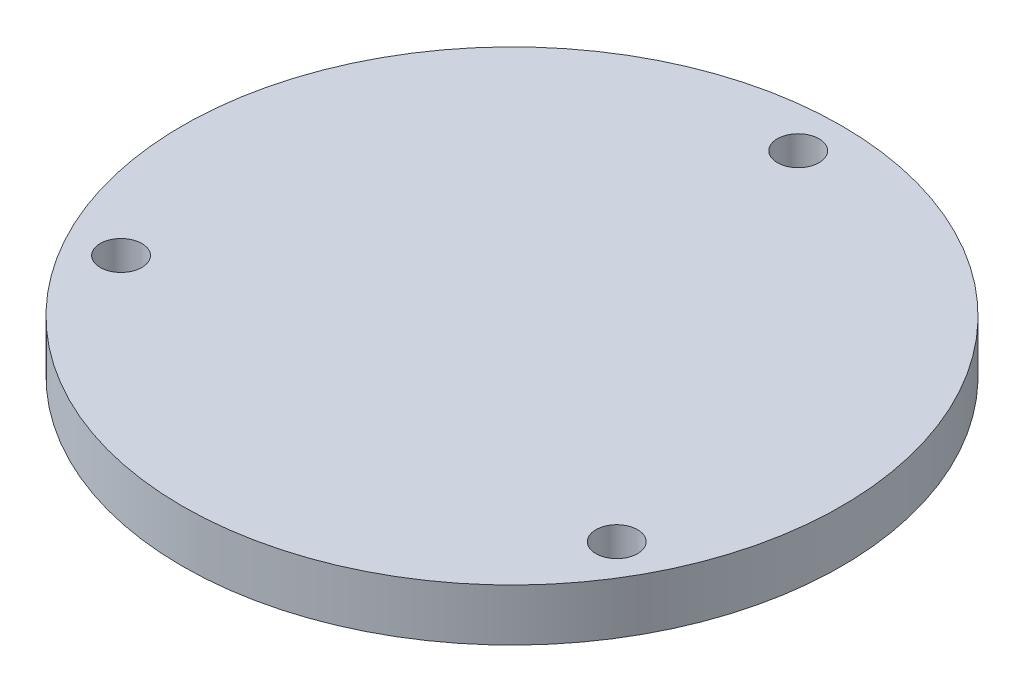
ISO-10303-21;
HEADER;
FILE_DESCRIPTION(('STEP AP214'),'2;1');
FILE_NAME('part.step','',(''),(''),'','','');
FILE_SCHEMA(('AUTOMOTIVE_DESIGN { 1 0 10303 214 1 1 1 1 }'));
ENDSEC;
DATA;
#1=APPLICATION_CONTEXT('core data for automotive mechanical design processes');
#2=APPLICATION_PROTOCOL_DEFINITION('international standard','automotive_design',2000,#1);
#3=PRODUCT_CONTEXT('',#1,'mechanical');
#4=PRODUCT('Part','Part','',(#3));
#5=PRODUCT_RELATED_PRODUCT_CATEGORY('part','',(#4));
#6=PRODUCT_DEFINITION_FORMATION('','',#4);
#7=PRODUCT_DEFINITION_CONTEXT('part definition',#1,'design');
#8=PRODUCT_DEFINITION('design','',#6,#7);
#9=PRODUCT_DEFINITION_SHAPE('','',#8);
#10=(LENGTH_UNIT() NAMED_UNIT(*) SI_UNIT(.MILLI.,.METRE.));
#11=(NAMED_UNIT(*) PLANE_ANGLE_UNIT() SI_UNIT($,.RADIAN.));
#12=(NAMED_UNIT(*) SI_UNIT($,.STERADIAN.) SOLID_ANGLE_UNIT());
#13=UNCERTAINTY_MEASURE_WITH_UNIT(LENGTH_MEASURE(1.E-05),#10,'distance_accuracy_value','');
#14=(GEOMETRIC_REPRESENTATION_CONTEXT(3) GLOBAL_UNCERTAINTY_ASSIGNED_CONTEXT((#13)) GLOBAL_UNIT_ASSIGNED_CONTEXT((#10,
#11,#12)) REPRESENTATION_CONTEXT('',''));
#15=CARTESIAN_POINT('',(0.,0.,0.));
#16=DIRECTION('',(0.,0.,1.));
#17=DIRECTION('',(1.,0.,0.));
#18=AXIS2_PLACEMENT_3D('',#15,#16,#17);
#19=CARTESIAN_POINT('',(0.,3.,0.));
#20=DIRECTION('',(0.,-1.,0.));
#21=DIRECTION('',(0.,0.,-1.));
#22=AXIS2_PLACEMENT_3D('',#19,#20,#21);
#23=CYLINDRICAL_SURFACE('',#22,19.);
#24=CARTESIAN_POINT('',(0.,3.,0.));
#25=DIRECTION('',(0.,1.,0.));
#26=DIRECTION('',(0.,0.,1.));
#27=AXIS2_PLACEMENT_3D('',#24,#25,#26);
#28=CIRCLE('',#27,19.);
#29=CARTESIAN_POINT('',(0.,3.,19.));
#30=VERTEX_POINT('',#29);
#31=EDGE_CURVE('E10',#30,#30,#28,.T.);
#32=ORIENTED_EDGE('',*,*,#31,.F.);
#33=EDGE_LOOP('',(#32));
#34=FACE_BOUND('',#33,.T.);
#35=CARTESIAN_POINT('',(0.,0.,0.));
#36=DIRECTION('',(0.,1.,0.));
#37=DIRECTION('',(0.,0.,1.));
#38=AXIS2_PLACEMENT_3D('',#35,#36,#37);
#39=CIRCLE('',#38,19.);
#40=CARTESIAN_POINT('',(0.,0.,19.));
#41=VERTEX_POINT('',#40);
#42=EDGE_CURVE('E34',#41,#41,#39,.T.);
#43=ORIENTED_EDGE('',*,*,#42,.T.);
#44=EDGE_LOOP('',(#43));
#45=FACE_BOUND('',#44,.T.);
#46=ADVANCED_FACE('F31',(#34,#45),#23,.T.);
#47=CARTESIAN_POINT('',(0.,3.,0.));
#48=DIRECTION('',(0.,1.,0.));
#49=DIRECTION('',(0.,0.,1.));
#50=AXIS2_PLACEMENT_3D('',#47,#48,#49);
#51=PLANE('',#50);
#52=CARTESIAN_POINT('',(0.,3.,-16.5));
#53=DIRECTION('',(0.,1.,0.));
#54=DIRECTION('',(0.,0.,1.));
#55=AXIS2_PLACEMENT_3D('',#52,#53,#54);
#56=CIRCLE('',#55,1.2);
#57=CARTESIAN_POINT('',(0.,3.,-15.3));
#58=VERTEX_POINT('',#57);
#59=EDGE_CURVE('E57',#58,#58,#56,.T.);
#60=ORIENTED_EDGE('',*,*,#59,.F.);
#61=EDGE_LOOP('',(#60));
#62=FACE_BOUND('',#61,.T.);
#63=CARTESIAN_POINT('',(-14.2894191624432,3.,8.25));
#64=DIRECTION('',(0.,1.,0.));
#65=DIRECTION('',(0.,0.,1.));
#66=AXIS2_PLACEMENT_3D('',#63,#64,#65);
#67=CIRCLE('',#66,1.2);
#68=CARTESIAN_POINT('',(-14.2894191624432,3.,9.45));
#69=VERTEX_POINT('',#68);
#70=EDGE_CURVE('E51',#69,#69,#67,.T.);
#71=ORIENTED_EDGE('',*,*,#70,.F.);
#72=EDGE_LOOP('',(#71));
#73=FACE_BOUND('',#72,.T.);
#74=CARTESIAN_POINT('',(14.2894191624432,3.,8.25));
#75=DIRECTION('',(0.,1.,0.));
#76=DIRECTION('',(0.,0.,1.));
#77=AXIS2_PLACEMENT_3D('',#74,#75,#76);
#78=CIRCLE('',#77,1.2);
#79=CARTESIAN_POINT('',(14.2894191624432,3.,9.45));
#80=VERTEX_POINT('',#79);
#81=EDGE_CURVE('E45',#80,#80,#78,.T.);
#82=ORIENTED_EDGE('',*,*,#81,.F.);
#83=EDGE_LOOP('',(#82));
#84=FACE_BOUND('',#83,.T.);
#85=ORIENTED_EDGE('',*,*,#31,.T.);
#86=EDGE_LOOP('',(#85));
#87=FACE_BOUND('',#86,.T.);
#88=ADVANCED_FACE('F63',(#62,#73,#84,#87),#51,.T.);
#89=CARTESIAN_POINT('',(0.,0.,0.));
#90=DIRECTION('',(0.,1.,0.));
#91=DIRECTION('',(0.,0.,1.));
#92=AXIS2_PLACEMENT_3D('',#89,#90,#91);
#93=PLANE('',#92);
#94=CARTESIAN_POINT('',(0.,0.,-16.5));
#95=DIRECTION('',(0.,1.,0.));
#96=DIRECTION('',(0.,0.,1.));
#97=AXIS2_PLACEMENT_3D('',#94,#95,#96);
#98=CIRCLE('',#97,1.2);
#99=CARTESIAN_POINT('',(0.,0.,-15.3));
#100=VERTEX_POINT('',#99);
#101=EDGE_CURVE('E54',#100,#100,#98,.T.);
#102=ORIENTED_EDGE('',*,*,#101,.T.);
#103=EDGE_LOOP('',(#102));
#104=FACE_BOUND('',#103,.T.);
#105=CARTESIAN_POINT('',(-14.2894191624432,0.,8.25));
#106=DIRECTION('',(0.,1.,0.));
#107=DIRECTION('',(0.,0.,1.));
#108=AXIS2_PLACEMENT_3D('',#105,#106,#107);
#109=CIRCLE('',#108,1.2);
#110=CARTESIAN_POINT('',(-14.2894191624432,0.,9.45));
#111=VERTEX_POINT('',#110);
#112=EDGE_CURVE('E48',#111,#111,#109,.T.);
#113=ORIENTED_EDGE('',*,*,#112,.T.);
#114=EDGE_LOOP('',(#113));
#115=FACE_BOUND('',#114,.T.);
#116=CARTESIAN_POINT('',(14.2894191624432,0.,8.25));
#117=DIRECTION('',(0.,1.,0.));
#118=DIRECTION('',(0.,0.,1.));
#119=AXIS2_PLACEMENT_3D('',#116,#117,#118);
#120=CIRCLE('',#119,1.2);
#121=CARTESIAN_POINT('',(14.2894191624432,0.,9.45));
#122=VERTEX_POINT('',#121);
#123=EDGE_CURVE('E41',#122,#122,#120,.T.);
#124=ORIENTED_EDGE('',*,*,#123,.T.);
#125=EDGE_LOOP('',(#124));
#126=FACE_BOUND('',#125,.T.);
#127=ORIENTED_EDGE('',*,*,#42,.F.);
#128=EDGE_LOOP('',(#127));
#129=FACE_BOUND('',#128,.T.);
#130=ADVANCED_FACE('F66',(#104,#115,#126,#129),#93,.F.);
#131=CARTESIAN_POINT('',(14.2894191624432,3.,8.25));
#132=DIRECTION('',(0.,1.,0.));
#133=DIRECTION('',(0.,0.,1.));
#134=AXIS2_PLACEMENT_3D('',#131,#132,#133);
#135=CYLINDRICAL_SURFACE('',#134,1.2);
#136=ORIENTED_EDGE('',*,*,#123,.F.);
#137=EDGE_LOOP('',(#136));
#138=FACE_BOUND('',#137,.T.);
#139=ORIENTED_EDGE('',*,*,#81,.T.);
#140=EDGE_LOOP('',(#139));
#141=FACE_BOUND('',#140,.T.);
#142=ADVANCED_FACE('F72',(#138,#141),#135,.F.);
#143=CARTESIAN_POINT('',(-14.2894191624432,3.,8.25));
#144=DIRECTION('',(0.,1.,0.));
#145=DIRECTION('',(0.,0.,1.));
#146=AXIS2_PLACEMENT_3D('',#143,#144,#145);
#147=CYLINDRICAL_SURFACE('',#146,1.2);
#148=ORIENTED_EDGE('',*,*,#112,.F.);
#149=EDGE_LOOP('',(#148));
#150=FACE_BOUND('',#149,.T.);
#151=ORIENTED_EDGE('',*,*,#70,.T.);
#152=EDGE_LOOP('',(#151));
#153=FACE_BOUND('',#152,.T.);
#154=ADVANCED_FACE('F74',(#150,#153),#147,.F.);
#155=CARTESIAN_POINT('',(0.,3.,-16.5));
#156=DIRECTION('',(0.,1.,0.));
#157=DIRECTION('',(0.,0.,1.));
#158=AXIS2_PLACEMENT_3D('',#155,#156,#157);
#159=CYLINDRICAL_SURFACE('',#158,1.2);
#160=ORIENTED_EDGE('',*,*,#101,.F.);
#161=EDGE_LOOP('',(#160));
#162=FACE_BOUND('',#161,.T.);
#163=ORIENTED_EDGE('',*,*,#59,.T.);
#164=EDGE_LOOP('',(#163));
#165=FACE_BOUND('',#164,.T.);
#166=ADVANCED_FACE('F61',(#162,#165),#159,.F.);
#167=CLOSED_SHELL('',(#46,#88,#130,#142,#154,#166));
#168=MANIFOLD_SOLID_BREP('B2',#167);
#169=ADVANCED_BREP_SHAPE_REPRESENTATION('',(#18,#168),#14);
#170=SHAPE_DEFINITION_REPRESENTATION(#9,#169);
ENDSEC;
END-ISO-10303-21;
